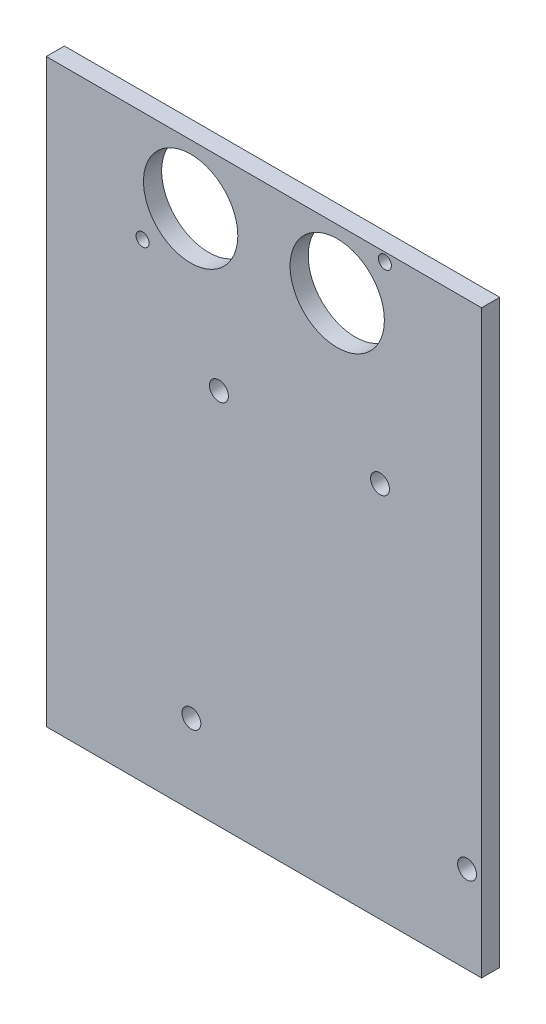
ISO-10303-21;
HEADER;
FILE_DESCRIPTION(('STEP AP214'),'2;1');
FILE_NAME('part.step','',(''),(''),'','','');
FILE_SCHEMA(('AUTOMOTIVE_DESIGN { 1 0 10303 214 1 1 1 1 }'));
ENDSEC;
DATA;
#1=APPLICATION_CONTEXT('core data for automotive mechanical design processes');
#2=APPLICATION_PROTOCOL_DEFINITION('international standard','automotive_design',2000,#1);
#3=PRODUCT_CONTEXT('',#1,'mechanical');
#4=PRODUCT('Part','Part','',(#3));
#5=PRODUCT_RELATED_PRODUCT_CATEGORY('part','',(#4));
#6=PRODUCT_DEFINITION_FORMATION('','',#4);
#7=PRODUCT_DEFINITION_CONTEXT('part definition',#1,'design');
#8=PRODUCT_DEFINITION('design','',#6,#7);
#9=PRODUCT_DEFINITION_SHAPE('','',#8);
#10=(LENGTH_UNIT() NAMED_UNIT(*) SI_UNIT(.MILLI.,.METRE.));
#11=(NAMED_UNIT(*) PLANE_ANGLE_UNIT() SI_UNIT($,.RADIAN.));
#12=(NAMED_UNIT(*) SI_UNIT($,.STERADIAN.) SOLID_ANGLE_UNIT());
#13=UNCERTAINTY_MEASURE_WITH_UNIT(LENGTH_MEASURE(1.E-05),#10,'distance_accuracy_value','');
#14=(GEOMETRIC_REPRESENTATION_CONTEXT(3) GLOBAL_UNCERTAINTY_ASSIGNED_CONTEXT((#13)) GLOBAL_UNIT_ASSIGNED_CONTEXT((#10,
#11,#12)) REPRESENTATION_CONTEXT('',''));
#15=CARTESIAN_POINT('',(0.,0.,0.));
#16=DIRECTION('',(0.,0.,1.));
#17=DIRECTION('',(1.,0.,0.));
#18=AXIS2_PLACEMENT_3D('',#15,#16,#17);
#19=CARTESIAN_POINT('',(0.,0.,3.175));
#20=DIRECTION('',(1.,0.,0.));
#21=DIRECTION('',(0.,0.,-1.));
#22=AXIS2_PLACEMENT_3D('',#19,#20,#21);
#23=PLANE('',#22);
#24=DIRECTION('',(0.,-1.,0.));
#25=VECTOR('',#24,1.);
#26=CARTESIAN_POINT('',(0.,0.,0.));
#27=LINE('',#26,#25);
#28=CARTESIAN_POINT('',(0.,101.6,0.));
#29=VERTEX_POINT('',#28);
#30=CARTESIAN_POINT('',(0.,0.,0.));
#31=VERTEX_POINT('',#30);
#32=EDGE_CURVE('E112',#29,#31,#27,.T.);
#33=ORIENTED_EDGE('',*,*,#32,.T.);
#34=DIRECTION('',(0.,0.,-1.));
#35=VECTOR('',#34,1.);
#36=CARTESIAN_POINT('',(0.,0.,3.175));
#37=LINE('',#36,#35);
#38=CARTESIAN_POINT('',(0.,0.,3.175));
#39=VERTEX_POINT('',#38);
#40=EDGE_CURVE('E11',#39,#31,#37,.T.);
#41=ORIENTED_EDGE('',*,*,#40,.F.);
#42=DIRECTION('',(0.,-1.,0.));
#43=VECTOR('',#42,1.);
#44=CARTESIAN_POINT('',(0.,0.,3.175));
#45=LINE('',#44,#43);
#46=CARTESIAN_POINT('',(0.,101.6,3.175));
#47=VERTEX_POINT('',#46);
#48=EDGE_CURVE('E96',#47,#39,#45,.T.);
#49=ORIENTED_EDGE('',*,*,#48,.F.);
#50=DIRECTION('',(0.,0.,-1.));
#51=VECTOR('',#50,1.);
#52=CARTESIAN_POINT('',(0.,101.6,3.175));
#53=LINE('',#52,#51);
#54=EDGE_CURVE('E108',#47,#29,#53,.T.);
#55=ORIENTED_EDGE('',*,*,#54,.T.);
#56=EDGE_LOOP('',(#33,#41,#49,#55));
#57=FACE_BOUND('',#56,.T.);
#58=ADVANCED_FACE('F44',(#57),#23,.F.);
#59=CARTESIAN_POINT('',(0.,0.,3.175));
#60=DIRECTION('',(0.,1.,0.));
#61=DIRECTION('',(0.,0.,1.));
#62=AXIS2_PLACEMENT_3D('',#59,#60,#61);
#63=PLANE('',#62);
#64=DIRECTION('',(1.,0.,0.));
#65=VECTOR('',#64,1.);
#66=CARTESIAN_POINT('',(0.,0.,0.));
#67=LINE('',#66,#65);
#68=CARTESIAN_POINT('',(76.2,0.,0.));
#69=VERTEX_POINT('',#68);
#70=EDGE_CURVE('E101',#31,#69,#67,.T.);
#71=ORIENTED_EDGE('',*,*,#70,.T.);
#72=DIRECTION('',(0.,0.,-1.));
#73=VECTOR('',#72,1.);
#74=CARTESIAN_POINT('',(76.2,0.,3.175));
#75=LINE('',#74,#73);
#76=CARTESIAN_POINT('',(76.2,0.,3.175));
#77=VERTEX_POINT('',#76);
#78=EDGE_CURVE('E53',#77,#69,#75,.T.);
#79=ORIENTED_EDGE('',*,*,#78,.F.);
#80=DIRECTION('',(1.,0.,0.));
#81=VECTOR('',#80,1.);
#82=CARTESIAN_POINT('',(0.,0.,3.175));
#83=LINE('',#82,#81);
#84=EDGE_CURVE('E91',#39,#77,#83,.T.);
#85=ORIENTED_EDGE('',*,*,#84,.F.);
#86=ORIENTED_EDGE('',*,*,#40,.T.);
#87=EDGE_LOOP('',(#71,#79,#85,#86));
#88=FACE_BOUND('',#87,.T.);
#89=ADVANCED_FACE('F100',(#88),#63,.F.);
#90=CARTESIAN_POINT('',(76.2,0.,3.175));
#91=DIRECTION('',(-1.,0.,0.));
#92=DIRECTION('',(0.,0.,1.));
#93=AXIS2_PLACEMENT_3D('',#90,#91,#92);
#94=PLANE('',#93);
#95=DIRECTION('',(0.,1.,0.));
#96=VECTOR('',#95,1.);
#97=CARTESIAN_POINT('',(76.2,0.,0.));
#98=LINE('',#97,#96);
#99=CARTESIAN_POINT('',(76.2,101.6,0.));
#100=VERTEX_POINT('',#99);
#101=EDGE_CURVE('E78',#69,#100,#98,.T.);
#102=ORIENTED_EDGE('',*,*,#101,.T.);
#103=DIRECTION('',(0.,0.,-1.));
#104=VECTOR('',#103,1.);
#105=CARTESIAN_POINT('',(76.2,101.6,3.175));
#106=LINE('',#105,#104);
#107=CARTESIAN_POINT('',(76.2,101.6,3.175));
#108=VERTEX_POINT('',#107);
#109=EDGE_CURVE('E103',#108,#100,#106,.T.);
#110=ORIENTED_EDGE('',*,*,#109,.F.);
#111=DIRECTION('',(0.,1.,0.));
#112=VECTOR('',#111,1.);
#113=CARTESIAN_POINT('',(76.2,0.,3.175));
#114=LINE('',#113,#112);
#115=EDGE_CURVE('E94',#77,#108,#114,.T.);
#116=ORIENTED_EDGE('',*,*,#115,.F.);
#117=ORIENTED_EDGE('',*,*,#78,.T.);
#118=EDGE_LOOP('',(#102,#110,#116,#117));
#119=FACE_BOUND('',#118,.T.);
#120=ADVANCED_FACE('F104',(#119),#94,.F.);
#121=CARTESIAN_POINT('',(0.,101.6,3.175));
#122=DIRECTION('',(0.,-1.,0.));
#123=DIRECTION('',(0.,0.,-1.));
#124=AXIS2_PLACEMENT_3D('',#121,#122,#123);
#125=PLANE('',#124);
#126=DIRECTION('',(-1.,0.,0.));
#127=VECTOR('',#126,1.);
#128=CARTESIAN_POINT('',(0.,101.6,0.));
#129=LINE('',#128,#127);
#130=EDGE_CURVE('E84',#100,#29,#129,.T.);
#131=ORIENTED_EDGE('',*,*,#130,.T.);
#132=ORIENTED_EDGE('',*,*,#54,.F.);
#133=DIRECTION('',(-1.,0.,0.));
#134=VECTOR('',#133,1.);
#135=CARTESIAN_POINT('',(0.,101.6,3.175));
#136=LINE('',#135,#134);
#137=EDGE_CURVE('E61',#108,#47,#136,.T.);
#138=ORIENTED_EDGE('',*,*,#137,.F.);
#139=ORIENTED_EDGE('',*,*,#109,.T.);
#140=EDGE_LOOP('',(#131,#132,#138,#139));
#141=FACE_BOUND('',#140,.T.);
#142=ADVANCED_FACE('F126',(#141),#125,.F.);
#143=CARTESIAN_POINT('',(0.,0.,3.175));
#144=DIRECTION('',(0.,0.,-1.));
#145=DIRECTION('',(-1.,0.,0.));
#146=AXIS2_PLACEMENT_3D('',#143,#144,#145);
#147=PLANE('',#146);
#148=CARTESIAN_POINT('',(73.66,15.24,3.175));
#149=DIRECTION('',(0.,0.,-1.));
#150=DIRECTION('',(-1.,0.,0.));
#151=AXIS2_PLACEMENT_3D('',#148,#149,#150);
#152=CIRCLE('',#151,1.65099999999999);
#153=CARTESIAN_POINT('',(72.009,15.24,3.175));
#154=VERTEX_POINT('',#153);
#155=EDGE_CURVE('E146',#154,#154,#152,.T.);
#156=ORIENTED_EDGE('',*,*,#155,.T.);
#157=EDGE_LOOP('',(#156));
#158=FACE_BOUND('',#157,.T.);
#159=CARTESIAN_POINT('',(25.4,13.97,3.175));
#160=DIRECTION('',(0.,0.,-1.));
#161=DIRECTION('',(-1.,0.,0.));
#162=AXIS2_PLACEMENT_3D('',#159,#160,#161);
#163=CIRCLE('',#162,1.651);
#164=CARTESIAN_POINT('',(23.749,13.97,3.175));
#165=VERTEX_POINT('',#164);
#166=EDGE_CURVE('E181',#165,#165,#163,.T.);
#167=ORIENTED_EDGE('',*,*,#166,.T.);
#168=EDGE_LOOP('',(#167));
#169=FACE_BOUND('',#168,.T.);
#170=CARTESIAN_POINT('',(30.226,66.04,3.175));
#171=DIRECTION('',(0.,0.,-1.));
#172=DIRECTION('',(-1.,0.,0.));
#173=AXIS2_PLACEMENT_3D('',#170,#171,#172);
#174=CIRCLE('',#173,1.651);
#175=CARTESIAN_POINT('',(28.575,66.04,3.175));
#176=VERTEX_POINT('',#175);
#177=EDGE_CURVE('E173',#176,#176,#174,.T.);
#178=ORIENTED_EDGE('',*,*,#177,.T.);
#179=EDGE_LOOP('',(#178));
#180=FACE_BOUND('',#179,.T.);
#181=CARTESIAN_POINT('',(58.42,66.04,3.175));
#182=DIRECTION('',(0.,0.,-1.));
#183=DIRECTION('',(-1.,0.,0.));
#184=AXIS2_PLACEMENT_3D('',#181,#182,#183);
#185=CIRCLE('',#184,1.651);
#186=CARTESIAN_POINT('',(56.769,66.04,3.175));
#187=VERTEX_POINT('',#186);
#188=EDGE_CURVE('E165',#187,#187,#185,.T.);
#189=ORIENTED_EDGE('',*,*,#188,.T.);
#190=EDGE_LOOP('',(#189));
#191=FACE_BOUND('',#190,.T.);
#192=CARTESIAN_POINT('',(16.851530294049,82.2959999999999,3.175));
#193=DIRECTION('',(0.,0.,1.));
#194=DIRECTION('',(1.,0.,0.));
#195=AXIS2_PLACEMENT_3D('',#192,#193,#194);
#196=CIRCLE('',#195,1.143);
#197=CARTESIAN_POINT('',(17.994530294049,82.2959999999999,3.175));
#198=VERTEX_POINT('',#197);
#199=EDGE_CURVE('E145',#198,#198,#196,.T.);
#200=ORIENTED_EDGE('',*,*,#199,.F.);
#201=EDGE_LOOP('',(#200));
#202=FACE_BOUND('',#201,.T.);
#203=CARTESIAN_POINT('',(50.927,91.186,3.175));
#204=DIRECTION('',(0.,0.,1.));
#205=DIRECTION('',(1.,0.,0.));
#206=AXIS2_PLACEMENT_3D('',#203,#204,#205);
#207=CIRCLE('',#206,8.255);
#208=CARTESIAN_POINT('',(59.182,91.186,3.175));
#209=VERTEX_POINT('',#208);
#210=EDGE_CURVE('E137',#209,#209,#207,.T.);
#211=ORIENTED_EDGE('',*,*,#210,.F.);
#212=EDGE_LOOP('',(#211));
#213=FACE_BOUND('',#212,.T.);
#214=CARTESIAN_POINT('',(59.269530294049,100.076,3.175));
#215=DIRECTION('',(0.,0.,1.));
#216=DIRECTION('',(1.,0.,0.));
#217=AXIS2_PLACEMENT_3D('',#214,#215,#216);
#218=CIRCLE('',#217,1.143);
#219=CARTESIAN_POINT('',(60.412530294049,100.076,3.175));
#220=VERTEX_POINT('',#219);
#221=EDGE_CURVE('E155',#220,#220,#218,.T.);
#222=ORIENTED_EDGE('',*,*,#221,.F.);
#223=EDGE_LOOP('',(#222));
#224=FACE_BOUND('',#223,.T.);
#225=CARTESIAN_POINT('',(25.273,91.186,3.175));
#226=DIRECTION('',(0.,0.,1.));
#227=DIRECTION('',(1.,0.,0.));
#228=AXIS2_PLACEMENT_3D('',#225,#226,#227);
#229=CIRCLE('',#228,8.255);
#230=CARTESIAN_POINT('',(33.528,91.186,3.175));
#231=VERTEX_POINT('',#230);
#232=EDGE_CURVE('E133',#231,#231,#229,.T.);
#233=ORIENTED_EDGE('',*,*,#232,.F.);
#234=EDGE_LOOP('',(#233));
#235=FACE_BOUND('',#234,.T.);
#236=ORIENTED_EDGE('',*,*,#48,.T.);
#237=ORIENTED_EDGE('',*,*,#84,.T.);
#238=ORIENTED_EDGE('',*,*,#115,.T.);
#239=ORIENTED_EDGE('',*,*,#137,.T.);
#240=EDGE_LOOP('',(#236,#237,#238,#239));
#241=FACE_BOUND('',#240,.T.);
#242=ADVANCED_FACE('F92',(#158,#169,#180,#191,#202,#213,#224,#235,#241),#147,.F.);
#243=CARTESIAN_POINT('',(0.,0.,0.));
#244=DIRECTION('',(0.,0.,-1.));
#245=DIRECTION('',(-1.,0.,0.));
#246=AXIS2_PLACEMENT_3D('',#243,#244,#245);
#247=PLANE('',#246);
#248=CARTESIAN_POINT('',(73.66,15.24,0.));
#249=DIRECTION('',(0.,0.,-1.));
#250=DIRECTION('',(-1.,0.,0.));
#251=AXIS2_PLACEMENT_3D('',#248,#249,#250);
#252=CIRCLE('',#251,1.65099999999999);
#253=CARTESIAN_POINT('',(72.009,15.24,0.));
#254=VERTEX_POINT('',#253);
#255=EDGE_CURVE('E189',#254,#254,#252,.T.);
#256=ORIENTED_EDGE('',*,*,#255,.F.);
#257=EDGE_LOOP('',(#256));
#258=FACE_BOUND('',#257,.T.);
#259=CARTESIAN_POINT('',(25.4,13.97,0.));
#260=DIRECTION('',(0.,0.,-1.));
#261=DIRECTION('',(-1.,0.,0.));
#262=AXIS2_PLACEMENT_3D('',#259,#260,#261);
#263=CIRCLE('',#262,1.651);
#264=CARTESIAN_POINT('',(23.749,13.97,0.));
#265=VERTEX_POINT('',#264);
#266=EDGE_CURVE('E185',#265,#265,#263,.T.);
#267=ORIENTED_EDGE('',*,*,#266,.F.);
#268=EDGE_LOOP('',(#267));
#269=FACE_BOUND('',#268,.T.);
#270=CARTESIAN_POINT('',(30.226,66.04,0.));
#271=DIRECTION('',(0.,0.,-1.));
#272=DIRECTION('',(-1.,0.,0.));
#273=AXIS2_PLACEMENT_3D('',#270,#271,#272);
#274=CIRCLE('',#273,1.651);
#275=CARTESIAN_POINT('',(28.575,66.04,0.));
#276=VERTEX_POINT('',#275);
#277=EDGE_CURVE('E177',#276,#276,#274,.T.);
#278=ORIENTED_EDGE('',*,*,#277,.F.);
#279=EDGE_LOOP('',(#278));
#280=FACE_BOUND('',#279,.T.);
#281=CARTESIAN_POINT('',(58.42,66.04,0.));
#282=DIRECTION('',(0.,0.,-1.));
#283=DIRECTION('',(-1.,0.,0.));
#284=AXIS2_PLACEMENT_3D('',#281,#282,#283);
#285=CIRCLE('',#284,1.651);
#286=CARTESIAN_POINT('',(56.769,66.04,0.));
#287=VERTEX_POINT('',#286);
#288=EDGE_CURVE('E169',#287,#287,#285,.T.);
#289=ORIENTED_EDGE('',*,*,#288,.F.);
#290=EDGE_LOOP('',(#289));
#291=FACE_BOUND('',#290,.T.);
#292=CARTESIAN_POINT('',(16.851530294049,82.2959999999999,0.));
#293=DIRECTION('',(0.,0.,1.));
#294=DIRECTION('',(1.,0.,0.));
#295=AXIS2_PLACEMENT_3D('',#292,#293,#294);
#296=CIRCLE('',#295,1.143);
#297=CARTESIAN_POINT('',(17.994530294049,82.2959999999999,0.));
#298=VERTEX_POINT('',#297);
#299=EDGE_CURVE('E141',#298,#298,#296,.T.);
#300=ORIENTED_EDGE('',*,*,#299,.T.);
#301=EDGE_LOOP('',(#300));
#302=FACE_BOUND('',#301,.T.);
#303=CARTESIAN_POINT('',(50.927,91.186,0.));
#304=DIRECTION('',(0.,0.,1.));
#305=DIRECTION('',(1.,0.,0.));
#306=AXIS2_PLACEMENT_3D('',#303,#304,#305);
#307=CIRCLE('',#306,8.255);
#308=CARTESIAN_POINT('',(59.182,91.186,0.));
#309=VERTEX_POINT('',#308);
#310=EDGE_CURVE('E151',#309,#309,#307,.T.);
#311=ORIENTED_EDGE('',*,*,#310,.T.);
#312=EDGE_LOOP('',(#311));
#313=FACE_BOUND('',#312,.T.);
#314=CARTESIAN_POINT('',(59.269530294049,100.076,0.));
#315=DIRECTION('',(0.,0.,1.));
#316=DIRECTION('',(1.,0.,0.));
#317=AXIS2_PLACEMENT_3D('',#314,#315,#316);
#318=CIRCLE('',#317,1.143);
#319=CARTESIAN_POINT('',(60.412530294049,100.076,0.));
#320=VERTEX_POINT('',#319);
#321=EDGE_CURVE('E150',#320,#320,#318,.T.);
#322=ORIENTED_EDGE('',*,*,#321,.T.);
#323=EDGE_LOOP('',(#322));
#324=FACE_BOUND('',#323,.T.);
#325=CARTESIAN_POINT('',(25.273,91.186,0.));
#326=DIRECTION('',(0.,0.,1.));
#327=DIRECTION('',(1.,0.,0.));
#328=AXIS2_PLACEMENT_3D('',#325,#326,#327);
#329=CIRCLE('',#328,8.255);
#330=CARTESIAN_POINT('',(33.528,91.186,0.));
#331=VERTEX_POINT('',#330);
#332=EDGE_CURVE('E116',#331,#331,#329,.T.);
#333=ORIENTED_EDGE('',*,*,#332,.T.);
#334=EDGE_LOOP('',(#333));
#335=FACE_BOUND('',#334,.T.);
#336=ORIENTED_EDGE('',*,*,#32,.F.);
#337=ORIENTED_EDGE('',*,*,#130,.F.);
#338=ORIENTED_EDGE('',*,*,#101,.F.);
#339=ORIENTED_EDGE('',*,*,#70,.F.);
#340=EDGE_LOOP('',(#336,#337,#338,#339));
#341=FACE_BOUND('',#340,.T.);
#342=ADVANCED_FACE('F129',(#258,#269,#280,#291,#302,#313,#324,#335,#341),#247,.T.);
#343=CARTESIAN_POINT('',(25.273,91.186,0.));
#344=DIRECTION('',(0.,0.,1.));
#345=DIRECTION('',(1.,0.,0.));
#346=AXIS2_PLACEMENT_3D('',#343,#344,#345);
#347=CYLINDRICAL_SURFACE('',#346,8.255);
#348=ORIENTED_EDGE('',*,*,#332,.F.);
#349=EDGE_LOOP('',(#348));
#350=FACE_BOUND('',#349,.T.);
#351=ORIENTED_EDGE('',*,*,#232,.T.);
#352=EDGE_LOOP('',(#351));
#353=FACE_BOUND('',#352,.T.);
#354=ADVANCED_FACE('F208',(#350,#353),#347,.F.);
#355=CARTESIAN_POINT('',(59.269530294049,100.076,0.));
#356=DIRECTION('',(0.,0.,1.));
#357=DIRECTION('',(1.,0.,0.));
#358=AXIS2_PLACEMENT_3D('',#355,#356,#357);
#359=CYLINDRICAL_SURFACE('',#358,1.143);
#360=ORIENTED_EDGE('',*,*,#321,.F.);
#361=EDGE_LOOP('',(#360));
#362=FACE_BOUND('',#361,.T.);
#363=ORIENTED_EDGE('',*,*,#221,.T.);
#364=EDGE_LOOP('',(#363));
#365=FACE_BOUND('',#364,.T.);
#366=ADVANCED_FACE('F226',(#362,#365),#359,.F.);
#367=CARTESIAN_POINT('',(50.927,91.186,0.));
#368=DIRECTION('',(0.,0.,1.));
#369=DIRECTION('',(1.,0.,0.));
#370=AXIS2_PLACEMENT_3D('',#367,#368,#369);
#371=CYLINDRICAL_SURFACE('',#370,8.255);
#372=ORIENTED_EDGE('',*,*,#310,.F.);
#373=EDGE_LOOP('',(#372));
#374=FACE_BOUND('',#373,.T.);
#375=ORIENTED_EDGE('',*,*,#210,.T.);
#376=EDGE_LOOP('',(#375));
#377=FACE_BOUND('',#376,.T.);
#378=ADVANCED_FACE('F265',(#374,#377),#371,.F.);
#379=CARTESIAN_POINT('',(16.851530294049,82.2959999999999,0.));
#380=DIRECTION('',(0.,0.,1.));
#381=DIRECTION('',(1.,0.,0.));
#382=AXIS2_PLACEMENT_3D('',#379,#380,#381);
#383=CYLINDRICAL_SURFACE('',#382,1.143);
#384=ORIENTED_EDGE('',*,*,#299,.F.);
#385=EDGE_LOOP('',(#384));
#386=FACE_BOUND('',#385,.T.);
#387=ORIENTED_EDGE('',*,*,#199,.T.);
#388=EDGE_LOOP('',(#387));
#389=FACE_BOUND('',#388,.T.);
#390=ADVANCED_FACE('F273',(#386,#389),#383,.F.);
#391=CARTESIAN_POINT('',(58.42,66.04,3.175));
#392=DIRECTION('',(0.,0.,-1.));
#393=DIRECTION('',(-1.,0.,0.));
#394=AXIS2_PLACEMENT_3D('',#391,#392,#393);
#395=CYLINDRICAL_SURFACE('',#394,1.651);
#396=ORIENTED_EDGE('',*,*,#188,.F.);
#397=EDGE_LOOP('',(#396));
#398=FACE_BOUND('',#397,.T.);
#399=ORIENTED_EDGE('',*,*,#288,.T.);
#400=EDGE_LOOP('',(#399));
#401=FACE_BOUND('',#400,.T.);
#402=ADVANCED_FACE('F281',(#398,#401),#395,.F.);
#403=CARTESIAN_POINT('',(30.226,66.04,3.175));
#404=DIRECTION('',(0.,0.,-1.));
#405=DIRECTION('',(-1.,0.,0.));
#406=AXIS2_PLACEMENT_3D('',#403,#404,#405);
#407=CYLINDRICAL_SURFACE('',#406,1.651);
#408=ORIENTED_EDGE('',*,*,#177,.F.);
#409=EDGE_LOOP('',(#408));
#410=FACE_BOUND('',#409,.T.);
#411=ORIENTED_EDGE('',*,*,#277,.T.);
#412=EDGE_LOOP('',(#411));
#413=FACE_BOUND('',#412,.T.);
#414=ADVANCED_FACE('F294',(#410,#413),#407,.F.);
#415=CARTESIAN_POINT('',(25.4,13.97,3.175));
#416=DIRECTION('',(0.,0.,-1.));
#417=DIRECTION('',(-1.,0.,0.));
#418=AXIS2_PLACEMENT_3D('',#415,#416,#417);
#419=CYLINDRICAL_SURFACE('',#418,1.651);
#420=ORIENTED_EDGE('',*,*,#166,.F.);
#421=EDGE_LOOP('',(#420));
#422=FACE_BOUND('',#421,.T.);
#423=ORIENTED_EDGE('',*,*,#266,.T.);
#424=EDGE_LOOP('',(#423));
#425=FACE_BOUND('',#424,.T.);
#426=ADVANCED_FACE('F202',(#422,#425),#419,.F.);
#427=CARTESIAN_POINT('',(73.66,15.24,3.175));
#428=DIRECTION('',(0.,0.,-1.));
#429=DIRECTION('',(-1.,0.,0.));
#430=AXIS2_PLACEMENT_3D('',#427,#428,#429);
#431=CYLINDRICAL_SURFACE('',#430,1.65099999999999);
#432=ORIENTED_EDGE('',*,*,#155,.F.);
#433=EDGE_LOOP('',(#432));
#434=FACE_BOUND('',#433,.T.);
#435=ORIENTED_EDGE('',*,*,#255,.T.);
#436=EDGE_LOOP('',(#435));
#437=FACE_BOUND('',#436,.T.);
#438=ADVANCED_FACE('F199',(#434,#437),#431,.F.);
#439=CLOSED_SHELL('',(#58,#89,#120,#142,#242,#342,#354,#366,#378,#390,#402,#414,#426,#438));
#440=MANIFOLD_SOLID_BREP('B2',#439);
#441=ADVANCED_BREP_SHAPE_REPRESENTATION('',(#18,#440),#14);
#442=SHAPE_DEFINITION_REPRESENTATION(#9,#441);
ENDSEC;
END-ISO-10303-21;
